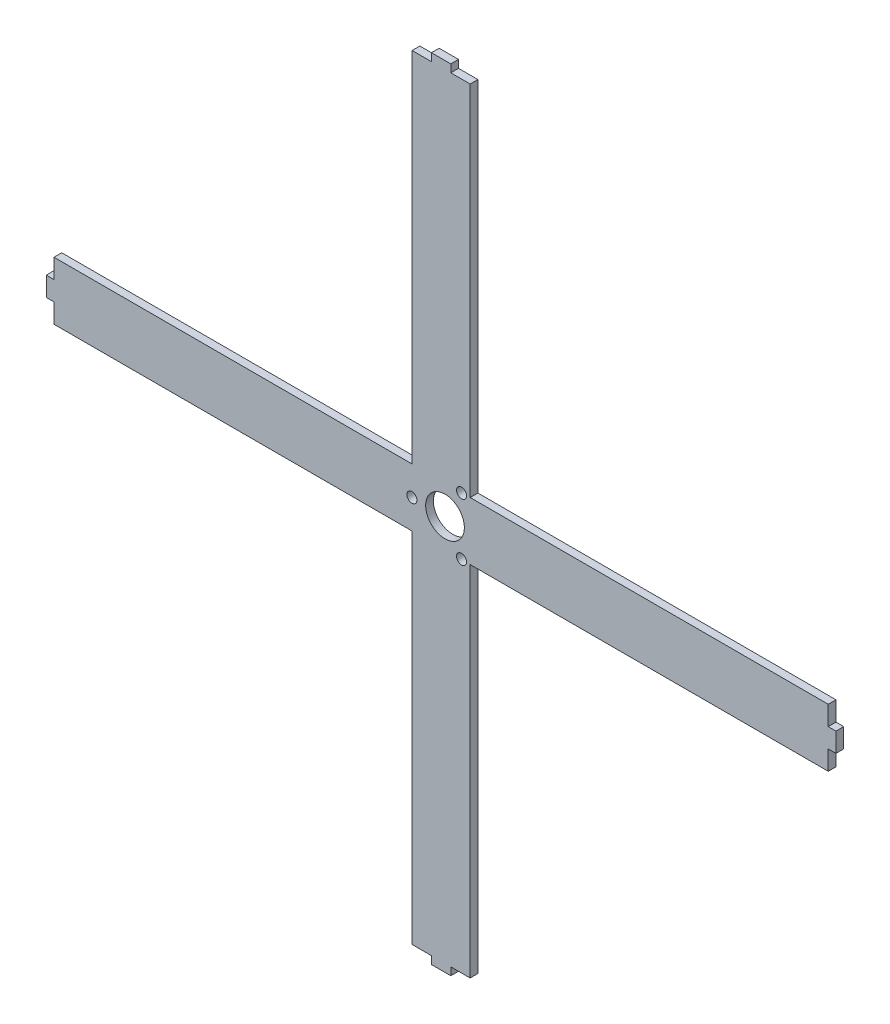
ISO-10303-21;
HEADER;
FILE_DESCRIPTION(('STEP AP214'),'2;1');
FILE_NAME('part.step','',(''),(''),'','','');
FILE_SCHEMA(('AUTOMOTIVE_DESIGN { 1 0 10303 214 1 1 1 1 }'));
ENDSEC;
DATA;
#1=APPLICATION_CONTEXT('core data for automotive mechanical design processes');
#2=APPLICATION_PROTOCOL_DEFINITION('international standard','automotive_design',2000,#1);
#3=PRODUCT_CONTEXT('',#1,'mechanical');
#4=PRODUCT('Part','Part','',(#3));
#5=PRODUCT_RELATED_PRODUCT_CATEGORY('part','',(#4));
#6=PRODUCT_DEFINITION_FORMATION('','',#4);
#7=PRODUCT_DEFINITION_CONTEXT('part definition',#1,'design');
#8=PRODUCT_DEFINITION('design','',#6,#7);
#9=PRODUCT_DEFINITION_SHAPE('','',#8);
#10=(LENGTH_UNIT() NAMED_UNIT(*) SI_UNIT(.MILLI.,.METRE.));
#11=(NAMED_UNIT(*) PLANE_ANGLE_UNIT() SI_UNIT($,.RADIAN.));
#12=(NAMED_UNIT(*) SI_UNIT($,.STERADIAN.) SOLID_ANGLE_UNIT());
#13=UNCERTAINTY_MEASURE_WITH_UNIT(LENGTH_MEASURE(1.E-05),#10,'distance_accuracy_value','');
#14=(GEOMETRIC_REPRESENTATION_CONTEXT(3) GLOBAL_UNCERTAINTY_ASSIGNED_CONTEXT((#13)) GLOBAL_UNIT_ASSIGNED_CONTEXT((#10,
#11,#12)) REPRESENTATION_CONTEXT('',''));
#15=CARTESIAN_POINT('',(0.,0.,0.));
#16=DIRECTION('',(0.,0.,1.));
#17=DIRECTION('',(1.,0.,0.));
#18=AXIS2_PLACEMENT_3D('',#15,#16,#17);
#19=CARTESIAN_POINT('',(162.342822384213,-326.680496364606,0.));
#20=DIRECTION('',(0.,0.,1.));
#21=DIRECTION('',(1.,0.,0.));
#22=AXIS2_PLACEMENT_3D('',#19,#20,#21);
#23=PLANE('',#22);
#24=CARTESIAN_POINT('',(148.486470786896,8.9002294559745,0.));
#25=DIRECTION('',(0.,0.,1.));
#26=DIRECTION('',(1.,0.,0.));
#27=AXIS2_PLACEMENT_3D('',#24,#25,#26);
#28=CIRCLE('',#27,2.6);
#29=CARTESIAN_POINT('',(151.086470786896,8.9002294559745,0.));
#30=VERTEX_POINT('',#29);
#31=EDGE_CURVE('E762',#30,#30,#28,.F.);
#32=ORIENTED_EDGE('',*,*,#31,.F.);
#33=EDGE_LOOP('',(#32));
#34=FACE_BOUND('',#33,.T.);
#35=CARTESIAN_POINT('',(174.136470786896,23.7092638606884,0.));
#36=DIRECTION('',(0.,0.,1.));
#37=DIRECTION('',(1.,0.,0.));
#38=AXIS2_PLACEMENT_3D('',#35,#36,#37);
#39=CIRCLE('',#38,2.6);
#40=CARTESIAN_POINT('',(176.736470786896,23.7092638606884,0.));
#41=VERTEX_POINT('',#40);
#42=EDGE_CURVE('E768',#41,#41,#39,.F.);
#43=ORIENTED_EDGE('',*,*,#42,.F.);
#44=EDGE_LOOP('',(#43));
#45=FACE_BOUND('',#44,.T.);
#46=DIRECTION('',(0.,1.,0.));
#47=VECTOR('',#46,1.);
#48=CARTESIAN_POINT('',(168.577070848987,204.900229455974,0.));
#49=LINE('',#48,#47);
#50=CARTESIAN_POINT('',(168.577070848987,208.900229455974,0.));
#51=VERTEX_POINT('',#50);
#52=CARTESIAN_POINT('',(168.577070848987,212.900229455974,0.));
#53=VERTEX_POINT('',#52);
#54=EDGE_CURVE('E554',#51,#53,#49,.T.);
#55=ORIENTED_EDGE('',*,*,#54,.F.);
#56=DIRECTION('',(1.,0.,0.));
#57=VECTOR('',#56,1.);
#58=CARTESIAN_POINT('',(162.342822384215,208.900229455974,0.));
#59=LINE('',#58,#57);
#60=CARTESIAN_POINT('',(178.577070848987,208.900229455974,0.));
#61=VERTEX_POINT('',#60);
#62=EDGE_CURVE('E703',#51,#61,#59,.T.);
#63=ORIENTED_EDGE('',*,*,#62,.T.);
#64=DIRECTION('',(0.,-1.,0.));
#65=VECTOR('',#64,1.);
#66=CARTESIAN_POINT('',(178.577070848986,-326.680496364606,0.));
#67=LINE('',#66,#65);
#68=CARTESIAN_POINT('',(178.577070848987,23.8896634175821,0.));
#69=VERTEX_POINT('',#68);
#70=EDGE_CURVE('E705',#61,#69,#67,.T.);
#71=ORIENTED_EDGE('',*,*,#70,.T.);
#72=DIRECTION('',(1.,0.,0.));
#73=VECTOR('',#72,1.);
#74=CARTESIAN_POINT('',(162.342822384213,23.8896634175821,0.));
#75=LINE('',#74,#73);
#76=CARTESIAN_POINT('',(363.586470786896,23.8896634175821,0.));
#77=VERTEX_POINT('',#76);
#78=EDGE_CURVE('E708',#69,#77,#75,.T.);
#79=ORIENTED_EDGE('',*,*,#78,.T.);
#80=DIRECTION('',(0.,1.,0.));
#81=VECTOR('',#80,1.);
#82=CARTESIAN_POINT('',(363.586470786896,-326.680496364606,0.));
#83=LINE('',#82,#81);
#84=CARTESIAN_POINT('',(363.586470786896,13.8896634175822,0.));
#85=VERTEX_POINT('',#84);
#86=EDGE_CURVE('E711',#85,#77,#83,.T.);
#87=ORIENTED_EDGE('',*,*,#86,.F.);
#88=DIRECTION('',(-1.,0.,0.));
#89=VECTOR('',#88,1.);
#90=CARTESIAN_POINT('',(367.586470786896,13.8896634175822,0.));
#91=LINE('',#90,#89);
#92=CARTESIAN_POINT('',(367.586470786896,13.8896634175822,0.));
#93=VERTEX_POINT('',#92);
#94=EDGE_CURVE('E614',#93,#85,#91,.T.);
#95=ORIENTED_EDGE('',*,*,#94,.F.);
#96=DIRECTION('',(0.,1.,0.));
#97=VECTOR('',#96,1.);
#98=CARTESIAN_POINT('',(367.586470786896,3.8896634175822,0.));
#99=LINE('',#98,#97);
#100=CARTESIAN_POINT('',(367.586470786896,3.8896634175822,0.));
#101=VERTEX_POINT('',#100);
#102=EDGE_CURVE('E590',#101,#93,#99,.T.);
#103=ORIENTED_EDGE('',*,*,#102,.F.);
#104=DIRECTION('',(-1.,0.,0.));
#105=VECTOR('',#104,1.);
#106=CARTESIAN_POINT('',(367.586470786896,3.8896634175822,0.));
#107=LINE('',#106,#105);
#108=CARTESIAN_POINT('',(363.586470786896,3.88966341758218,0.));
#109=VERTEX_POINT('',#108);
#110=EDGE_CURVE('E610',#101,#109,#107,.T.);
#111=ORIENTED_EDGE('',*,*,#110,.T.);
#112=CARTESIAN_POINT('',(363.586470786896,-6.11033658241776,0.));
#113=VERTEX_POINT('',#112);
#114=EDGE_CURVE('E712',#113,#109,#83,.T.);
#115=ORIENTED_EDGE('',*,*,#114,.F.);
#116=DIRECTION('',(1.,0.,0.));
#117=VECTOR('',#116,1.);
#118=CARTESIAN_POINT('',(162.342822384213,-6.11033658241783,0.));
#119=LINE('',#118,#117);
#120=CARTESIAN_POINT('',(178.577070848987,-6.11033658241782,0.));
#121=VERTEX_POINT('',#120);
#122=EDGE_CURVE('E715',#121,#113,#119,.T.);
#123=ORIENTED_EDGE('',*,*,#122,.F.);
#124=DIRECTION('',(0.,-1.,0.));
#125=VECTOR('',#124,1.);
#126=CARTESIAN_POINT('',(178.577070848986,-326.680496364606,0.));
#127=LINE('',#126,#125);
#128=CARTESIAN_POINT('',(178.577070848986,-191.099770544026,0.));
#129=VERTEX_POINT('',#128);
#130=EDGE_CURVE('E717',#121,#129,#127,.T.);
#131=ORIENTED_EDGE('',*,*,#130,.T.);
#132=DIRECTION('',(1.,0.,0.));
#133=VECTOR('',#132,1.);
#134=CARTESIAN_POINT('',(162.342822384213,-191.099770544026,0.));
#135=LINE('',#134,#133);
#136=CARTESIAN_POINT('',(168.577070848986,-191.099770544026,0.));
#137=VERTEX_POINT('',#136);
#138=EDGE_CURVE('E629',#137,#129,#135,.T.);
#139=ORIENTED_EDGE('',*,*,#138,.F.);
#140=DIRECTION('',(0.,1.,0.));
#141=VECTOR('',#140,1.);
#142=CARTESIAN_POINT('',(168.577070848986,-195.099770544026,0.));
#143=LINE('',#142,#141);
#144=CARTESIAN_POINT('',(168.577070848986,-195.099770544026,0.));
#145=VERTEX_POINT('',#144);
#146=EDGE_CURVE('E637',#145,#137,#143,.T.);
#147=ORIENTED_EDGE('',*,*,#146,.F.);
#148=DIRECTION('',(1.,0.,0.));
#149=VECTOR('',#148,1.);
#150=CARTESIAN_POINT('',(158.577070848986,-195.099770544026,0.));
#151=LINE('',#150,#149);
#152=CARTESIAN_POINT('',(158.577070848986,-195.099770544026,0.));
#153=VERTEX_POINT('',#152);
#154=EDGE_CURVE('E606',#153,#145,#151,.T.);
#155=ORIENTED_EDGE('',*,*,#154,.F.);
#156=DIRECTION('',(0.,1.,0.));
#157=VECTOR('',#156,1.);
#158=CARTESIAN_POINT('',(158.577070848986,-195.099770544026,0.));
#159=LINE('',#158,#157);
#160=CARTESIAN_POINT('',(158.577070848986,-191.099770544026,0.));
#161=VERTEX_POINT('',#160);
#162=EDGE_CURVE('E633',#153,#161,#159,.T.);
#163=ORIENTED_EDGE('',*,*,#162,.T.);
#164=CARTESIAN_POINT('',(148.577070848986,-191.099770544026,0.));
#165=VERTEX_POINT('',#164);
#166=EDGE_CURVE('E689',#165,#161,#135,.T.);
#167=ORIENTED_EDGE('',*,*,#166,.F.);
#168=DIRECTION('',(0.,-1.,0.));
#169=VECTOR('',#168,1.);
#170=CARTESIAN_POINT('',(148.577070848986,-326.680496364606,0.));
#171=LINE('',#170,#169);
#172=CARTESIAN_POINT('',(148.577070848987,-6.11033658241784,0.));
#173=VERTEX_POINT('',#172);
#174=EDGE_CURVE('E687',#173,#165,#171,.T.);
#175=ORIENTED_EDGE('',*,*,#174,.F.);
#176=DIRECTION('',(1.,0.,0.));
#177=VECTOR('',#176,1.);
#178=CARTESIAN_POINT('',(162.342822384213,-6.11033658241783,0.));
#179=LINE('',#178,#177);
#180=CARTESIAN_POINT('',(-36.4135292131036,-6.1103365824179,0.));
#181=VERTEX_POINT('',#180);
#182=EDGE_CURVE('E690',#181,#173,#179,.T.);
#183=ORIENTED_EDGE('',*,*,#182,.F.);
#184=DIRECTION('',(0.,1.,0.));
#185=VECTOR('',#184,1.);
#186=CARTESIAN_POINT('',(-36.4135292131036,-326.680496364606,0.));
#187=LINE('',#186,#185);
#188=CARTESIAN_POINT('',(-36.4135292131036,3.88966341758212,0.));
#189=VERTEX_POINT('',#188);
#190=EDGE_CURVE('E692',#181,#189,#187,.T.);
#191=ORIENTED_EDGE('',*,*,#190,.T.);
#192=DIRECTION('',(-1.,0.,0.));
#193=VECTOR('',#192,1.);
#194=CARTESIAN_POINT('',(-32.4135292131036,3.88966341758213,0.));
#195=LINE('',#194,#193);
#196=CARTESIAN_POINT('',(-40.4135292131036,3.88966341758213,0.));
#197=VERTEX_POINT('',#196);
#198=EDGE_CURVE('E573',#189,#197,#195,.T.);
#199=ORIENTED_EDGE('',*,*,#198,.T.);
#200=DIRECTION('',(0.,1.,0.));
#201=VECTOR('',#200,1.);
#202=CARTESIAN_POINT('',(-40.4135292131036,3.88966341758213,0.));
#203=LINE('',#202,#201);
#204=CARTESIAN_POINT('',(-40.4135292131036,13.8896634175821,0.));
#205=VERTEX_POINT('',#204);
#206=EDGE_CURVE('E594',#197,#205,#203,.T.);
#207=ORIENTED_EDGE('',*,*,#206,.T.);
#208=DIRECTION('',(-1.,0.,0.));
#209=VECTOR('',#208,1.);
#210=CARTESIAN_POINT('',(-32.4135292131036,13.8896634175821,0.));
#211=LINE('',#210,#209);
#212=CARTESIAN_POINT('',(-36.4135292131036,13.8896634175821,0.));
#213=VERTEX_POINT('',#212);
#214=EDGE_CURVE('E591',#213,#205,#211,.T.);
#215=ORIENTED_EDGE('',*,*,#214,.F.);
#216=CARTESIAN_POINT('',(-36.4135292131036,23.8896634175821,0.));
#217=VERTEX_POINT('',#216);
#218=EDGE_CURVE('E693',#213,#217,#187,.T.);
#219=ORIENTED_EDGE('',*,*,#218,.T.);
#220=DIRECTION('',(1.,0.,0.));
#221=VECTOR('',#220,1.);
#222=CARTESIAN_POINT('',(162.342822384213,23.8896634175821,0.));
#223=LINE('',#222,#221);
#224=CARTESIAN_POINT('',(148.577070848987,23.8896634175821,0.));
#225=VERTEX_POINT('',#224);
#226=EDGE_CURVE('E696',#217,#225,#223,.T.);
#227=ORIENTED_EDGE('',*,*,#226,.T.);
#228=DIRECTION('',(0.,-1.,0.));
#229=VECTOR('',#228,1.);
#230=CARTESIAN_POINT('',(148.577070848986,-326.680496364606,0.));
#231=LINE('',#230,#229);
#232=CARTESIAN_POINT('',(148.577070848987,208.900229455974,0.));
#233=VERTEX_POINT('',#232);
#234=EDGE_CURVE('E699',#233,#225,#231,.T.);
#235=ORIENTED_EDGE('',*,*,#234,.F.);
#236=CARTESIAN_POINT('',(158.577070848987,208.900229455974,0.));
#237=VERTEX_POINT('',#236);
#238=EDGE_CURVE('E702',#233,#237,#59,.T.);
#239=ORIENTED_EDGE('',*,*,#238,.T.);
#240=DIRECTION('',(0.,1.,0.));
#241=VECTOR('',#240,1.);
#242=CARTESIAN_POINT('',(158.577070848987,204.900229455974,0.));
#243=LINE('',#242,#241);
#244=CARTESIAN_POINT('',(158.577070848987,212.900229455974,0.));
#245=VERTEX_POINT('',#244);
#246=EDGE_CURVE('E548',#237,#245,#243,.T.);
#247=ORIENTED_EDGE('',*,*,#246,.T.);
#248=DIRECTION('',(1.,0.,0.));
#249=VECTOR('',#248,1.);
#250=CARTESIAN_POINT('',(158.577070848987,212.900229455974,0.));
#251=LINE('',#250,#249);
#252=EDGE_CURVE('E565',#245,#53,#251,.T.);
#253=ORIENTED_EDGE('',*,*,#252,.T.);
#254=EDGE_LOOP('',(#55,#63,#71,#79,#87,#95,#103,#111,#115,#123,#131,#139,#147,#155,#163,#167,
#175,#183,#191,#199,#207,#215,#219,#227,#235,#239,#247,#253));
#255=FACE_BOUND('',#254,.T.);
#256=CARTESIAN_POINT('',(174.136470786896,-5.9088049487394,0.));
#257=DIRECTION('',(0.,0.,1.));
#258=DIRECTION('',(1.,0.,0.));
#259=AXIS2_PLACEMENT_3D('',#256,#257,#258);
#260=CIRCLE('',#259,2.6);
#261=CARTESIAN_POINT('',(176.736470786896,-5.9088049487394,0.));
#262=VERTEX_POINT('',#261);
#263=EDGE_CURVE('E765',#262,#262,#260,.F.);
#264=ORIENTED_EDGE('',*,*,#263,.F.);
#265=EDGE_LOOP('',(#264));
#266=FACE_BOUND('',#265,.T.);
#267=CARTESIAN_POINT('',(165.586470786896,8.9002294559745,0.));
#268=DIRECTION('',(0.,0.,1.));
#269=DIRECTION('',(1.,0.,0.));
#270=AXIS2_PLACEMENT_3D('',#267,#268,#269);
#271=CIRCLE('',#270,10.);
#272=CARTESIAN_POINT('',(175.586470786896,8.9002294559745,0.));
#273=VERTEX_POINT('',#272);
#274=EDGE_CURVE('E576',#273,#273,#271,.F.);
#275=ORIENTED_EDGE('',*,*,#274,.F.);
#276=EDGE_LOOP('',(#275));
#277=FACE_BOUND('',#276,.T.);
#278=ADVANCED_FACE('F416',(#34,#45,#255,#266,#277),#23,.F.);
#279=CARTESIAN_POINT('',(162.342822384213,-326.680496364606,4.));
#280=DIRECTION('',(0.,0.,1.));
#281=DIRECTION('',(1.,0.,0.));
#282=AXIS2_PLACEMENT_3D('',#279,#280,#281);
#283=PLANE('',#282);
#284=DIRECTION('',(1.,0.,0.));
#285=VECTOR('',#284,1.);
#286=CARTESIAN_POINT('',(162.342822384213,23.8896634175821,4.));
#287=LINE('',#286,#285);
#288=CARTESIAN_POINT('',(178.577070848987,23.8896634175821,4.));
#289=VERTEX_POINT('',#288);
#290=CARTESIAN_POINT('',(363.586470786896,23.8896634175821,4.));
#291=VERTEX_POINT('',#290);
#292=EDGE_CURVE('E744',#289,#291,#287,.T.);
#293=ORIENTED_EDGE('',*,*,#292,.F.);
#294=DIRECTION('',(0.,-1.,0.));
#295=VECTOR('',#294,1.);
#296=CARTESIAN_POINT('',(178.577070848986,-326.680496364606,4.));
#297=LINE('',#296,#295);
#298=CARTESIAN_POINT('',(178.577070848987,208.900229455974,4.));
#299=VERTEX_POINT('',#298);
#300=EDGE_CURVE('E741',#299,#289,#297,.T.);
#301=ORIENTED_EDGE('',*,*,#300,.F.);
#302=DIRECTION('',(1.,0.,0.));
#303=VECTOR('',#302,1.);
#304=CARTESIAN_POINT('',(162.342822384215,208.900229455974,4.));
#305=LINE('',#304,#303);
#306=CARTESIAN_POINT('',(168.577070848987,208.900229455974,4.));
#307=VERTEX_POINT('',#306);
#308=EDGE_CURVE('E738',#307,#299,#305,.T.);
#309=ORIENTED_EDGE('',*,*,#308,.F.);
#310=DIRECTION('',(0.,1.,0.));
#311=VECTOR('',#310,1.);
#312=CARTESIAN_POINT('',(168.577070848987,204.900229455974,4.));
#313=LINE('',#312,#311);
#314=CARTESIAN_POINT('',(168.577070848987,212.900229455974,4.));
#315=VERTEX_POINT('',#314);
#316=EDGE_CURVE('E579',#307,#315,#313,.T.);
#317=ORIENTED_EDGE('',*,*,#316,.T.);
#318=DIRECTION('',(1.,0.,0.));
#319=VECTOR('',#318,1.);
#320=CARTESIAN_POINT('',(158.577070848987,212.900229455974,4.));
#321=LINE('',#320,#319);
#322=CARTESIAN_POINT('',(158.577070848987,212.900229455974,4.));
#323=VERTEX_POINT('',#322);
#324=EDGE_CURVE('E572',#323,#315,#321,.T.);
#325=ORIENTED_EDGE('',*,*,#324,.F.);
#326=DIRECTION('',(0.,1.,0.));
#327=VECTOR('',#326,1.);
#328=CARTESIAN_POINT('',(158.577070848987,204.900229455974,4.));
#329=LINE('',#328,#327);
#330=CARTESIAN_POINT('',(158.577070848987,208.900229455974,4.));
#331=VERTEX_POINT('',#330);
#332=EDGE_CURVE('E564',#331,#323,#329,.T.);
#333=ORIENTED_EDGE('',*,*,#332,.F.);
#334=CARTESIAN_POINT('',(148.577070848987,208.900229455974,4.));
#335=VERTEX_POINT('',#334);
#336=EDGE_CURVE('E737',#335,#331,#305,.T.);
#337=ORIENTED_EDGE('',*,*,#336,.F.);
#338=DIRECTION('',(0.,-1.,0.));
#339=VECTOR('',#338,1.);
#340=CARTESIAN_POINT('',(148.577070848986,-326.680496364606,4.));
#341=LINE('',#340,#339);
#342=CARTESIAN_POINT('',(148.577070848987,23.8896634175821,4.));
#343=VERTEX_POINT('',#342);
#344=EDGE_CURVE('E734',#335,#343,#341,.T.);
#345=ORIENTED_EDGE('',*,*,#344,.T.);
#346=DIRECTION('',(1.,0.,0.));
#347=VECTOR('',#346,1.);
#348=CARTESIAN_POINT('',(162.342822384213,23.8896634175821,4.));
#349=LINE('',#348,#347);
#350=CARTESIAN_POINT('',(-36.4135292131036,23.8896634175821,4.));
#351=VERTEX_POINT('',#350);
#352=EDGE_CURVE('E731',#351,#343,#349,.T.);
#353=ORIENTED_EDGE('',*,*,#352,.F.);
#354=DIRECTION('',(0.,1.,0.));
#355=VECTOR('',#354,1.);
#356=CARTESIAN_POINT('',(-36.4135292131036,-326.680496364606,4.));
#357=LINE('',#356,#355);
#358=CARTESIAN_POINT('',(-36.4135292131036,13.8896634175821,4.));
#359=VERTEX_POINT('',#358);
#360=EDGE_CURVE('E728',#359,#351,#357,.T.);
#361=ORIENTED_EDGE('',*,*,#360,.F.);
#362=DIRECTION('',(-1.,0.,0.));
#363=VECTOR('',#362,1.);
#364=CARTESIAN_POINT('',(-32.4135292131036,13.8896634175821,4.));
#365=LINE('',#364,#363);
#366=CARTESIAN_POINT('',(-40.4135292131036,13.8896634175821,4.));
#367=VERTEX_POINT('',#366);
#368=EDGE_CURVE('E587',#359,#367,#365,.T.);
#369=ORIENTED_EDGE('',*,*,#368,.T.);
#370=DIRECTION('',(0.,1.,0.));
#371=VECTOR('',#370,1.);
#372=CARTESIAN_POINT('',(-40.4135292131036,3.88966341758213,4.));
#373=LINE('',#372,#371);
#374=CARTESIAN_POINT('',(-40.4135292131036,3.88966341758213,4.));
#375=VERTEX_POINT('',#374);
#376=EDGE_CURVE('E599',#375,#367,#373,.T.);
#377=ORIENTED_EDGE('',*,*,#376,.F.);
#378=DIRECTION('',(-1.,0.,0.));
#379=VECTOR('',#378,1.);
#380=CARTESIAN_POINT('',(-32.4135292131036,3.88966341758213,4.));
#381=LINE('',#380,#379);
#382=CARTESIAN_POINT('',(-36.4135292131036,3.88966341758212,4.));
#383=VERTEX_POINT('',#382);
#384=EDGE_CURVE('E593',#383,#375,#381,.T.);
#385=ORIENTED_EDGE('',*,*,#384,.F.);
#386=CARTESIAN_POINT('',(-36.4135292131036,-6.1103365824179,4.));
#387=VERTEX_POINT('',#386);
#388=EDGE_CURVE('E727',#387,#383,#357,.T.);
#389=ORIENTED_EDGE('',*,*,#388,.F.);
#390=DIRECTION('',(1.,0.,0.));
#391=VECTOR('',#390,1.);
#392=CARTESIAN_POINT('',(162.342822384213,-6.11033658241783,4.));
#393=LINE('',#392,#391);
#394=CARTESIAN_POINT('',(148.577070848987,-6.11033658241784,4.));
#395=VERTEX_POINT('',#394);
#396=EDGE_CURVE('E724',#387,#395,#393,.T.);
#397=ORIENTED_EDGE('',*,*,#396,.T.);
#398=DIRECTION('',(0.,-1.,0.));
#399=VECTOR('',#398,1.);
#400=CARTESIAN_POINT('',(148.577070848986,-326.680496364606,4.));
#401=LINE('',#400,#399);
#402=CARTESIAN_POINT('',(148.577070848986,-191.099770544026,4.));
#403=VERTEX_POINT('',#402);
#404=EDGE_CURVE('E722',#395,#403,#401,.T.);
#405=ORIENTED_EDGE('',*,*,#404,.T.);
#406=DIRECTION('',(1.,0.,0.));
#407=VECTOR('',#406,1.);
#408=CARTESIAN_POINT('',(162.342822384213,-191.099770544026,4.));
#409=LINE('',#408,#407);
#410=CARTESIAN_POINT('',(158.577070848986,-191.099770544026,4.));
#411=VERTEX_POINT('',#410);
#412=EDGE_CURVE('E686',#403,#411,#409,.T.);
#413=ORIENTED_EDGE('',*,*,#412,.T.);
#414=DIRECTION('',(0.,1.,0.));
#415=VECTOR('',#414,1.);
#416=CARTESIAN_POINT('',(158.577070848986,-195.099770544026,4.));
#417=LINE('',#416,#415);
#418=CARTESIAN_POINT('',(158.577070848986,-195.099770544026,4.));
#419=VERTEX_POINT('',#418);
#420=EDGE_CURVE('E632',#419,#411,#417,.T.);
#421=ORIENTED_EDGE('',*,*,#420,.F.);
#422=DIRECTION('',(1.,0.,0.));
#423=VECTOR('',#422,1.);
#424=CARTESIAN_POINT('',(158.577070848986,-195.099770544026,4.));
#425=LINE('',#424,#423);
#426=CARTESIAN_POINT('',(168.577070848986,-195.099770544026,4.));
#427=VERTEX_POINT('',#426);
#428=EDGE_CURVE('E636',#419,#427,#425,.T.);
#429=ORIENTED_EDGE('',*,*,#428,.T.);
#430=DIRECTION('',(0.,1.,0.));
#431=VECTOR('',#430,1.);
#432=CARTESIAN_POINT('',(168.577070848986,-195.099770544026,4.));
#433=LINE('',#432,#431);
#434=CARTESIAN_POINT('',(168.577070848986,-191.099770544026,4.));
#435=VERTEX_POINT('',#434);
#436=EDGE_CURVE('E643',#427,#435,#433,.T.);
#437=ORIENTED_EDGE('',*,*,#436,.T.);
#438=CARTESIAN_POINT('',(178.577070848986,-191.099770544026,4.));
#439=VERTEX_POINT('',#438);
#440=EDGE_CURVE('E757',#435,#439,#409,.T.);
#441=ORIENTED_EDGE('',*,*,#440,.T.);
#442=DIRECTION('',(0.,-1.,0.));
#443=VECTOR('',#442,1.);
#444=CARTESIAN_POINT('',(178.577070848986,-326.680496364606,4.));
#445=LINE('',#444,#443);
#446=CARTESIAN_POINT('',(178.577070848987,-6.11033658241782,4.));
#447=VERTEX_POINT('',#446);
#448=EDGE_CURVE('E754',#447,#439,#445,.T.);
#449=ORIENTED_EDGE('',*,*,#448,.F.);
#450=DIRECTION('',(1.,0.,0.));
#451=VECTOR('',#450,1.);
#452=CARTESIAN_POINT('',(162.342822384213,-6.11033658241783,4.));
#453=LINE('',#452,#451);
#454=CARTESIAN_POINT('',(363.586470786896,-6.11033658241776,4.));
#455=VERTEX_POINT('',#454);
#456=EDGE_CURVE('E751',#447,#455,#453,.T.);
#457=ORIENTED_EDGE('',*,*,#456,.T.);
#458=DIRECTION('',(0.,1.,0.));
#459=VECTOR('',#458,1.);
#460=CARTESIAN_POINT('',(363.586470786896,-326.680496364606,4.));
#461=LINE('',#460,#459);
#462=CARTESIAN_POINT('',(363.586470786896,3.88966341758218,4.));
#463=VERTEX_POINT('',#462);
#464=EDGE_CURVE('E748',#455,#463,#461,.T.);
#465=ORIENTED_EDGE('',*,*,#464,.T.);
#466=DIRECTION('',(-1.,0.,0.));
#467=VECTOR('',#466,1.);
#468=CARTESIAN_POINT('',(367.586470786896,3.8896634175822,4.));
#469=LINE('',#468,#467);
#470=CARTESIAN_POINT('',(367.586470786896,3.8896634175822,4.));
#471=VERTEX_POINT('',#470);
#472=EDGE_CURVE('E609',#471,#463,#469,.T.);
#473=ORIENTED_EDGE('',*,*,#472,.F.);
#474=DIRECTION('',(0.,1.,0.));
#475=VECTOR('',#474,1.);
#476=CARTESIAN_POINT('',(367.586470786896,3.8896634175822,4.));
#477=LINE('',#476,#475);
#478=CARTESIAN_POINT('',(367.586470786896,13.8896634175822,4.));
#479=VERTEX_POINT('',#478);
#480=EDGE_CURVE('E613',#471,#479,#477,.T.);
#481=ORIENTED_EDGE('',*,*,#480,.T.);
#482=DIRECTION('',(-1.,0.,0.));
#483=VECTOR('',#482,1.);
#484=CARTESIAN_POINT('',(367.586470786896,13.8896634175822,4.));
#485=LINE('',#484,#483);
#486=CARTESIAN_POINT('',(363.586470786896,13.8896634175822,4.));
#487=VERTEX_POINT('',#486);
#488=EDGE_CURVE('E621',#479,#487,#485,.T.);
#489=ORIENTED_EDGE('',*,*,#488,.T.);
#490=EDGE_CURVE('E747',#487,#291,#461,.T.);
#491=ORIENTED_EDGE('',*,*,#490,.T.);
#492=EDGE_LOOP('',(#293,#301,#309,#317,#325,#333,#337,#345,#353,#361,#369,#377,#385,#389,#397,
#405,#413,#421,#429,#437,#441,#449,#457,#465,#473,#481,#489,#491));
#493=FACE_BOUND('',#492,.T.);
#494=CARTESIAN_POINT('',(148.486470786896,8.9002294559745,4.));
#495=DIRECTION('',(0.,0.,1.));
#496=DIRECTION('',(1.,0.,0.));
#497=AXIS2_PLACEMENT_3D('',#494,#495,#496);
#498=CIRCLE('',#497,2.6);
#499=CARTESIAN_POINT('',(151.086470786896,8.9002294559745,4.));
#500=VERTEX_POINT('',#499);
#501=EDGE_CURVE('E777',#500,#500,#498,.F.);
#502=ORIENTED_EDGE('',*,*,#501,.T.);
#503=EDGE_LOOP('',(#502));
#504=FACE_BOUND('',#503,.T.);
#505=CARTESIAN_POINT('',(174.136470786896,23.7092638606884,4.));
#506=DIRECTION('',(0.,0.,1.));
#507=DIRECTION('',(1.,0.,0.));
#508=AXIS2_PLACEMENT_3D('',#505,#506,#507);
#509=CIRCLE('',#508,2.6);
#510=CARTESIAN_POINT('',(176.736470786896,23.7092638606884,4.));
#511=VERTEX_POINT('',#510);
#512=EDGE_CURVE('E771',#511,#511,#509,.F.);
#513=ORIENTED_EDGE('',*,*,#512,.T.);
#514=EDGE_LOOP('',(#513));
#515=FACE_BOUND('',#514,.T.);
#516=CARTESIAN_POINT('',(174.136470786896,-5.9088049487394,4.));
#517=DIRECTION('',(0.,0.,1.));
#518=DIRECTION('',(1.,0.,0.));
#519=AXIS2_PLACEMENT_3D('',#516,#517,#518);
#520=CIRCLE('',#519,2.6);
#521=CARTESIAN_POINT('',(176.736470786896,-5.9088049487394,4.));
#522=VERTEX_POINT('',#521);
#523=EDGE_CURVE('E774',#522,#522,#520,.F.);
#524=ORIENTED_EDGE('',*,*,#523,.T.);
#525=EDGE_LOOP('',(#524));
#526=FACE_BOUND('',#525,.T.);
#527=CARTESIAN_POINT('',(165.586470786896,8.9002294559745,4.));
#528=DIRECTION('',(0.,0.,1.));
#529=DIRECTION('',(1.,0.,0.));
#530=AXIS2_PLACEMENT_3D('',#527,#528,#529);
#531=CIRCLE('',#530,10.);
#532=CARTESIAN_POINT('',(175.586470786896,8.9002294559745,4.));
#533=VERTEX_POINT('',#532);
#534=EDGE_CURVE('E780',#533,#533,#531,.F.);
#535=ORIENTED_EDGE('',*,*,#534,.T.);
#536=EDGE_LOOP('',(#535));
#537=FACE_BOUND('',#536,.T.);
#538=ADVANCED_FACE('F784',(#493,#504,#515,#526,#537),#283,.T.);
#539=CARTESIAN_POINT('',(162.342822384213,-191.099770544026,4.));
#540=DIRECTION('',(0.,1.,0.));
#541=DIRECTION('',(-1.,0.,0.));
#542=AXIS2_PLACEMENT_3D('',#539,#540,#541);
#543=PLANE('',#542);
#544=ORIENTED_EDGE('',*,*,#138,.T.);
#545=DIRECTION('',(0.,0.,-1.));
#546=VECTOR('',#545,1.);
#547=CARTESIAN_POINT('',(178.577070848986,-191.099770544026,4.));
#548=LINE('',#547,#546);
#549=EDGE_CURVE('E426',#439,#129,#548,.T.);
#550=ORIENTED_EDGE('',*,*,#549,.F.);
#551=ORIENTED_EDGE('',*,*,#440,.F.);
#552=DIRECTION('',(0.,0.,-1.));
#553=VECTOR('',#552,1.);
#554=CARTESIAN_POINT('',(168.577070848986,-191.099770544026,4.));
#555=LINE('',#554,#553);
#556=EDGE_CURVE('E12',#435,#137,#555,.T.);
#557=ORIENTED_EDGE('',*,*,#556,.T.);
#558=EDGE_LOOP('',(#544,#550,#551,#557));
#559=FACE_BOUND('',#558,.T.);
#560=ADVANCED_FACE('F800',(#559),#543,.F.);
#561=CARTESIAN_POINT('',(178.577070848986,-326.680496364606,4.));
#562=DIRECTION('',(1.,0.,0.));
#563=DIRECTION('',(0.,1.,0.));
#564=AXIS2_PLACEMENT_3D('',#561,#562,#563);
#565=PLANE('',#564);
#566=ORIENTED_EDGE('',*,*,#130,.F.);
#567=DIRECTION('',(0.,0.,-1.));
#568=VECTOR('',#567,1.);
#569=CARTESIAN_POINT('',(178.577070848987,-6.11033658241782,4.));
#570=LINE('',#569,#568);
#571=EDGE_CURVE('E649',#447,#121,#570,.T.);
#572=ORIENTED_EDGE('',*,*,#571,.F.);
#573=ORIENTED_EDGE('',*,*,#448,.T.);
#574=ORIENTED_EDGE('',*,*,#549,.T.);
#575=EDGE_LOOP('',(#566,#572,#573,#574));
#576=FACE_BOUND('',#575,.T.);
#577=ADVANCED_FACE('F851',(#576),#565,.T.);
#578=CARTESIAN_POINT('',(162.342822384213,-6.11033658241783,4.));
#579=DIRECTION('',(0.,1.,0.));
#580=DIRECTION('',(-1.,0.,0.));
#581=AXIS2_PLACEMENT_3D('',#578,#579,#580);
#582=PLANE('',#581);
#583=ORIENTED_EDGE('',*,*,#122,.T.);
#584=DIRECTION('',(0.,0.,-1.));
#585=VECTOR('',#584,1.);
#586=CARTESIAN_POINT('',(363.586470786896,-6.11033658241776,4.));
#587=LINE('',#586,#585);
#588=EDGE_CURVE('E651',#455,#113,#587,.T.);
#589=ORIENTED_EDGE('',*,*,#588,.F.);
#590=ORIENTED_EDGE('',*,*,#456,.F.);
#591=ORIENTED_EDGE('',*,*,#571,.T.);
#592=EDGE_LOOP('',(#583,#589,#590,#591));
#593=FACE_BOUND('',#592,.T.);
#594=ADVANCED_FACE('F848',(#593),#582,.F.);
#595=CARTESIAN_POINT('',(363.586470786896,-326.680496364606,4.));
#596=DIRECTION('',(-1.,0.,0.));
#597=DIRECTION('',(0.,0.,1.));
#598=AXIS2_PLACEMENT_3D('',#595,#596,#597);
#599=PLANE('',#598);
#600=ORIENTED_EDGE('',*,*,#114,.T.);
#601=DIRECTION('',(0.,0.,-1.));
#602=VECTOR('',#601,1.);
#603=CARTESIAN_POINT('',(363.586470786896,3.88966341758218,4.));
#604=LINE('',#603,#602);
#605=EDGE_CURVE('E654',#463,#109,#604,.T.);
#606=ORIENTED_EDGE('',*,*,#605,.F.);
#607=ORIENTED_EDGE('',*,*,#464,.F.);
#608=ORIENTED_EDGE('',*,*,#588,.T.);
#609=EDGE_LOOP('',(#600,#606,#607,#608));
#610=FACE_BOUND('',#609,.T.);
#611=ADVANCED_FACE('F846',(#610),#599,.F.);
#612=ORIENTED_EDGE('',*,*,#86,.T.);
#613=DIRECTION('',(0.,0.,-1.));
#614=VECTOR('',#613,1.);
#615=CARTESIAN_POINT('',(363.586470786896,23.8896634175821,4.));
#616=LINE('',#615,#614);
#617=EDGE_CURVE('E658',#291,#77,#616,.T.);
#618=ORIENTED_EDGE('',*,*,#617,.F.);
#619=ORIENTED_EDGE('',*,*,#490,.F.);
#620=DIRECTION('',(0.,0.,-1.));
#621=VECTOR('',#620,1.);
#622=CARTESIAN_POINT('',(363.586470786896,13.8896634175822,4.));
#623=LINE('',#622,#621);
#624=EDGE_CURVE('E656',#487,#85,#623,.T.);
#625=ORIENTED_EDGE('',*,*,#624,.T.);
#626=EDGE_LOOP('',(#612,#618,#619,#625));
#627=FACE_BOUND('',#626,.T.);
#628=ADVANCED_FACE('F842',(#627),#599,.F.);
#629=CARTESIAN_POINT('',(162.342822384213,23.8896634175821,4.));
#630=DIRECTION('',(0.,1.,0.));
#631=DIRECTION('',(-1.,0.,0.));
#632=AXIS2_PLACEMENT_3D('',#629,#630,#631);
#633=PLANE('',#632);
#634=ORIENTED_EDGE('',*,*,#78,.F.);
#635=DIRECTION('',(0.,0.,-1.));
#636=VECTOR('',#635,1.);
#637=CARTESIAN_POINT('',(178.577070848987,23.8896634175821,4.));
#638=LINE('',#637,#636);
#639=EDGE_CURVE('E660',#289,#69,#638,.T.);
#640=ORIENTED_EDGE('',*,*,#639,.F.);
#641=ORIENTED_EDGE('',*,*,#292,.T.);
#642=ORIENTED_EDGE('',*,*,#617,.T.);
#643=EDGE_LOOP('',(#634,#640,#641,#642));
#644=FACE_BOUND('',#643,.T.);
#645=ADVANCED_FACE('F838',(#644),#633,.T.);
#646=CARTESIAN_POINT('',(178.577070848986,-326.680496364606,4.));
#647=DIRECTION('',(1.,0.,0.));
#648=DIRECTION('',(0.,1.,0.));
#649=AXIS2_PLACEMENT_3D('',#646,#647,#648);
#650=PLANE('',#649);
#651=ORIENTED_EDGE('',*,*,#70,.F.);
#652=DIRECTION('',(0.,0.,-1.));
#653=VECTOR('',#652,1.);
#654=CARTESIAN_POINT('',(178.577070848987,208.900229455974,4.));
#655=LINE('',#654,#653);
#656=EDGE_CURVE('E662',#299,#61,#655,.T.);
#657=ORIENTED_EDGE('',*,*,#656,.F.);
#658=ORIENTED_EDGE('',*,*,#300,.T.);
#659=ORIENTED_EDGE('',*,*,#639,.T.);
#660=EDGE_LOOP('',(#651,#657,#658,#659));
#661=FACE_BOUND('',#660,.T.);
#662=ADVANCED_FACE('F835',(#661),#650,.T.);
#663=CARTESIAN_POINT('',(162.342822384215,208.900229455974,4.));
#664=DIRECTION('',(0.,1.,0.));
#665=DIRECTION('',(-1.,0.,0.));
#666=AXIS2_PLACEMENT_3D('',#663,#664,#665);
#667=PLANE('',#666);
#668=ORIENTED_EDGE('',*,*,#62,.F.);
#669=DIRECTION('',(0.,0.,-1.));
#670=VECTOR('',#669,1.);
#671=CARTESIAN_POINT('',(168.577070848987,208.900229455974,4.));
#672=LINE('',#671,#670);
#673=EDGE_CURVE('E561',#307,#51,#672,.T.);
#674=ORIENTED_EDGE('',*,*,#673,.F.);
#675=ORIENTED_EDGE('',*,*,#308,.T.);
#676=ORIENTED_EDGE('',*,*,#656,.T.);
#677=EDGE_LOOP('',(#668,#674,#675,#676));
#678=FACE_BOUND('',#677,.T.);
#679=ADVANCED_FACE('F833',(#678),#667,.T.);
#680=ORIENTED_EDGE('',*,*,#238,.F.);
#681=DIRECTION('',(0.,0.,-1.));
#682=VECTOR('',#681,1.);
#683=CARTESIAN_POINT('',(148.577070848987,208.900229455974,4.));
#684=LINE('',#683,#682);
#685=EDGE_CURVE('E667',#335,#233,#684,.T.);
#686=ORIENTED_EDGE('',*,*,#685,.F.);
#687=ORIENTED_EDGE('',*,*,#336,.T.);
#688=DIRECTION('',(0.,0.,-1.));
#689=VECTOR('',#688,1.);
#690=CARTESIAN_POINT('',(158.577070848987,208.900229455974,4.));
#691=LINE('',#690,#689);
#692=EDGE_CURVE('E665',#331,#237,#691,.T.);
#693=ORIENTED_EDGE('',*,*,#692,.T.);
#694=EDGE_LOOP('',(#680,#686,#687,#693));
#695=FACE_BOUND('',#694,.T.);
#696=ADVANCED_FACE('F829',(#695),#667,.T.);
#697=CARTESIAN_POINT('',(148.577070848986,-326.680496364606,4.));
#698=DIRECTION('',(1.,0.,0.));
#699=DIRECTION('',(0.,1.,0.));
#700=AXIS2_PLACEMENT_3D('',#697,#698,#699);
#701=PLANE('',#700);
#702=ORIENTED_EDGE('',*,*,#234,.T.);
#703=DIRECTION('',(0.,0.,-1.));
#704=VECTOR('',#703,1.);
#705=CARTESIAN_POINT('',(148.577070848987,23.8896634175821,4.));
#706=LINE('',#705,#704);
#707=EDGE_CURVE('E669',#343,#225,#706,.T.);
#708=ORIENTED_EDGE('',*,*,#707,.F.);
#709=ORIENTED_EDGE('',*,*,#344,.F.);
#710=ORIENTED_EDGE('',*,*,#685,.T.);
#711=EDGE_LOOP('',(#702,#708,#709,#710));
#712=FACE_BOUND('',#711,.T.);
#713=ADVANCED_FACE('F825',(#712),#701,.F.);
#714=CARTESIAN_POINT('',(162.342822384213,23.8896634175821,4.));
#715=DIRECTION('',(0.,1.,0.));
#716=DIRECTION('',(-1.,0.,0.));
#717=AXIS2_PLACEMENT_3D('',#714,#715,#716);
#718=PLANE('',#717);
#719=ORIENTED_EDGE('',*,*,#226,.F.);
#720=DIRECTION('',(0.,0.,-1.));
#721=VECTOR('',#720,1.);
#722=CARTESIAN_POINT('',(-36.4135292131036,23.8896634175821,4.));
#723=LINE('',#722,#721);
#724=EDGE_CURVE('E671',#351,#217,#723,.T.);
#725=ORIENTED_EDGE('',*,*,#724,.F.);
#726=ORIENTED_EDGE('',*,*,#352,.T.);
#727=ORIENTED_EDGE('',*,*,#707,.T.);
#728=EDGE_LOOP('',(#719,#725,#726,#727));
#729=FACE_BOUND('',#728,.T.);
#730=ADVANCED_FACE('F822',(#729),#718,.T.);
#731=CARTESIAN_POINT('',(-36.4135292131036,-326.680496364606,4.));
#732=DIRECTION('',(-1.,0.,0.));
#733=DIRECTION('',(0.,-1.,0.));
#734=AXIS2_PLACEMENT_3D('',#731,#732,#733);
#735=PLANE('',#734);
#736=ORIENTED_EDGE('',*,*,#218,.F.);
#737=DIRECTION('',(0.,0.,-1.));
#738=VECTOR('',#737,1.);
#739=CARTESIAN_POINT('',(-36.4135292131036,13.8896634175821,4.));
#740=LINE('',#739,#738);
#741=EDGE_CURVE('E673',#359,#213,#740,.T.);
#742=ORIENTED_EDGE('',*,*,#741,.F.);
#743=ORIENTED_EDGE('',*,*,#360,.T.);
#744=ORIENTED_EDGE('',*,*,#724,.T.);
#745=EDGE_LOOP('',(#736,#742,#743,#744));
#746=FACE_BOUND('',#745,.T.);
#747=ADVANCED_FACE('F820',(#746),#735,.T.);
#748=ORIENTED_EDGE('',*,*,#190,.F.);
#749=DIRECTION('',(0.,0.,-1.));
#750=VECTOR('',#749,1.);
#751=CARTESIAN_POINT('',(-36.4135292131036,-6.1103365824179,4.));
#752=LINE('',#751,#750);
#753=EDGE_CURVE('E677',#387,#181,#752,.T.);
#754=ORIENTED_EDGE('',*,*,#753,.F.);
#755=ORIENTED_EDGE('',*,*,#388,.T.);
#756=DIRECTION('',(0.,0.,-1.));
#757=VECTOR('',#756,1.);
#758=CARTESIAN_POINT('',(-36.4135292131036,3.88966341758212,4.));
#759=LINE('',#758,#757);
#760=EDGE_CURVE('E675',#383,#189,#759,.T.);
#761=ORIENTED_EDGE('',*,*,#760,.T.);
#762=EDGE_LOOP('',(#748,#754,#755,#761));
#763=FACE_BOUND('',#762,.T.);
#764=ADVANCED_FACE('F816',(#763),#735,.T.);
#765=CARTESIAN_POINT('',(162.342822384213,-6.11033658241783,4.));
#766=DIRECTION('',(0.,1.,0.));
#767=DIRECTION('',(-1.,0.,0.));
#768=AXIS2_PLACEMENT_3D('',#765,#766,#767);
#769=PLANE('',#768);
#770=ORIENTED_EDGE('',*,*,#182,.T.);
#771=DIRECTION('',(0.,0.,-1.));
#772=VECTOR('',#771,1.);
#773=CARTESIAN_POINT('',(148.577070848987,-6.11033658241784,4.));
#774=LINE('',#773,#772);
#775=EDGE_CURVE('E679',#395,#173,#774,.T.);
#776=ORIENTED_EDGE('',*,*,#775,.F.);
#777=ORIENTED_EDGE('',*,*,#396,.F.);
#778=ORIENTED_EDGE('',*,*,#753,.T.);
#779=EDGE_LOOP('',(#770,#776,#777,#778));
#780=FACE_BOUND('',#779,.T.);
#781=ADVANCED_FACE('F812',(#780),#769,.F.);
#782=CARTESIAN_POINT('',(148.577070848986,-326.680496364606,4.));
#783=DIRECTION('',(1.,0.,0.));
#784=DIRECTION('',(0.,1.,0.));
#785=AXIS2_PLACEMENT_3D('',#782,#783,#784);
#786=PLANE('',#785);
#787=ORIENTED_EDGE('',*,*,#174,.T.);
#788=DIRECTION('',(0.,0.,-1.));
#789=VECTOR('',#788,1.);
#790=CARTESIAN_POINT('',(148.577070848986,-191.099770544026,4.));
#791=LINE('',#790,#789);
#792=EDGE_CURVE('E682',#403,#165,#791,.T.);
#793=ORIENTED_EDGE('',*,*,#792,.F.);
#794=ORIENTED_EDGE('',*,*,#404,.F.);
#795=ORIENTED_EDGE('',*,*,#775,.T.);
#796=EDGE_LOOP('',(#787,#793,#794,#795));
#797=FACE_BOUND('',#796,.T.);
#798=ADVANCED_FACE('F809',(#797),#786,.F.);
#799=ORIENTED_EDGE('',*,*,#166,.T.);
#800=DIRECTION('',(0.,0.,-1.));
#801=VECTOR('',#800,1.);
#802=CARTESIAN_POINT('',(158.577070848986,-191.099770544026,4.));
#803=LINE('',#802,#801);
#804=EDGE_CURVE('E435',#411,#161,#803,.T.);
#805=ORIENTED_EDGE('',*,*,#804,.F.);
#806=ORIENTED_EDGE('',*,*,#412,.F.);
#807=ORIENTED_EDGE('',*,*,#792,.T.);
#808=EDGE_LOOP('',(#799,#805,#806,#807));
#809=FACE_BOUND('',#808,.T.);
#810=ADVANCED_FACE('F806',(#809),#543,.F.);
#811=CARTESIAN_POINT('',(168.577070848987,204.900229455974,4.));
#812=DIRECTION('',(-1.,0.,0.));
#813=DIRECTION('',(0.,-1.,0.));
#814=AXIS2_PLACEMENT_3D('',#811,#812,#813);
#815=PLANE('',#814);
#816=ORIENTED_EDGE('',*,*,#316,.F.);
#817=ORIENTED_EDGE('',*,*,#673,.T.);
#818=ORIENTED_EDGE('',*,*,#54,.T.);
#819=DIRECTION('',(0.,0.,-1.));
#820=VECTOR('',#819,1.);
#821=CARTESIAN_POINT('',(168.577070848987,212.900229455974,4.));
#822=LINE('',#821,#820);
#823=EDGE_CURVE('E558',#315,#53,#822,.T.);
#824=ORIENTED_EDGE('',*,*,#823,.F.);
#825=EDGE_LOOP('',(#816,#817,#818,#824));
#826=FACE_BOUND('',#825,.T.);
#827=ADVANCED_FACE('F557',(#826),#815,.F.);
#828=CARTESIAN_POINT('',(158.577070848987,212.900229455974,4.));
#829=DIRECTION('',(0.,1.,0.));
#830=DIRECTION('',(-1.,0.,0.));
#831=AXIS2_PLACEMENT_3D('',#828,#829,#830);
#832=PLANE('',#831);
#833=ORIENTED_EDGE('',*,*,#252,.F.);
#834=DIRECTION('',(0.,0.,-1.));
#835=VECTOR('',#834,1.);
#836=CARTESIAN_POINT('',(158.577070848987,212.900229455974,4.));
#837=LINE('',#836,#835);
#838=EDGE_CURVE('E420',#323,#245,#837,.T.);
#839=ORIENTED_EDGE('',*,*,#838,.F.);
#840=ORIENTED_EDGE('',*,*,#324,.T.);
#841=ORIENTED_EDGE('',*,*,#823,.T.);
#842=EDGE_LOOP('',(#833,#839,#840,#841));
#843=FACE_BOUND('',#842,.T.);
#844=ADVANCED_FACE('F569',(#843),#832,.T.);
#845=CARTESIAN_POINT('',(158.577070848987,204.900229455974,4.));
#846=DIRECTION('',(-1.,0.,0.));
#847=DIRECTION('',(0.,-1.,0.));
#848=AXIS2_PLACEMENT_3D('',#845,#846,#847);
#849=PLANE('',#848);
#850=ORIENTED_EDGE('',*,*,#246,.F.);
#851=ORIENTED_EDGE('',*,*,#692,.F.);
#852=ORIENTED_EDGE('',*,*,#332,.T.);
#853=ORIENTED_EDGE('',*,*,#838,.T.);
#854=EDGE_LOOP('',(#850,#851,#852,#853));
#855=FACE_BOUND('',#854,.T.);
#856=ADVANCED_FACE('F418',(#855),#849,.T.);
#857=CARTESIAN_POINT('',(-32.4135292131036,13.8896634175821,4.));
#858=DIRECTION('',(0.,-1.,0.));
#859=DIRECTION('',(0.,0.,-1.));
#860=AXIS2_PLACEMENT_3D('',#857,#858,#859);
#861=PLANE('',#860);
#862=ORIENTED_EDGE('',*,*,#368,.F.);
#863=ORIENTED_EDGE('',*,*,#741,.T.);
#864=ORIENTED_EDGE('',*,*,#214,.T.);
#865=DIRECTION('',(0.,0.,-1.));
#866=VECTOR('',#865,1.);
#867=CARTESIAN_POINT('',(-40.4135292131036,13.8896634175821,4.));
#868=LINE('',#867,#866);
#869=EDGE_CURVE('E586',#367,#205,#868,.T.);
#870=ORIENTED_EDGE('',*,*,#869,.F.);
#871=EDGE_LOOP('',(#862,#863,#864,#870));
#872=FACE_BOUND('',#871,.T.);
#873=ADVANCED_FACE('F883',(#872),#861,.F.);
#874=CARTESIAN_POINT('',(-40.4135292131036,3.88966341758213,4.));
#875=DIRECTION('',(-1.,0.,0.));
#876=DIRECTION('',(0.,0.,1.));
#877=AXIS2_PLACEMENT_3D('',#874,#875,#876);
#878=PLANE('',#877);
#879=ORIENTED_EDGE('',*,*,#206,.F.);
#880=DIRECTION('',(0.,0.,-1.));
#881=VECTOR('',#880,1.);
#882=CARTESIAN_POINT('',(-40.4135292131036,3.88966341758213,4.));
#883=LINE('',#882,#881);
#884=EDGE_CURVE('E583',#375,#197,#883,.T.);
#885=ORIENTED_EDGE('',*,*,#884,.F.);
#886=ORIENTED_EDGE('',*,*,#376,.T.);
#887=ORIENTED_EDGE('',*,*,#869,.T.);
#888=EDGE_LOOP('',(#879,#885,#886,#887));
#889=FACE_BOUND('',#888,.T.);
#890=ADVANCED_FACE('F879',(#889),#878,.T.);
#891=CARTESIAN_POINT('',(-32.4135292131036,3.88966341758213,4.));
#892=DIRECTION('',(0.,-1.,0.));
#893=DIRECTION('',(0.,0.,-1.));
#894=AXIS2_PLACEMENT_3D('',#891,#892,#893);
#895=PLANE('',#894);
#896=ORIENTED_EDGE('',*,*,#198,.F.);
#897=ORIENTED_EDGE('',*,*,#760,.F.);
#898=ORIENTED_EDGE('',*,*,#384,.T.);
#899=ORIENTED_EDGE('',*,*,#884,.T.);
#900=EDGE_LOOP('',(#896,#897,#898,#899));
#901=FACE_BOUND('',#900,.T.);
#902=ADVANCED_FACE('F877',(#901),#895,.T.);
#903=CARTESIAN_POINT('',(367.586470786896,13.8896634175822,4.));
#904=DIRECTION('',(0.,-1.,0.));
#905=DIRECTION('',(0.,0.,-1.));
#906=AXIS2_PLACEMENT_3D('',#903,#904,#905);
#907=PLANE('',#906);
#908=ORIENTED_EDGE('',*,*,#94,.T.);
#909=ORIENTED_EDGE('',*,*,#624,.F.);
#910=ORIENTED_EDGE('',*,*,#488,.F.);
#911=DIRECTION('',(0.,0.,-1.));
#912=VECTOR('',#911,1.);
#913=CARTESIAN_POINT('',(367.586470786896,13.8896634175822,4.));
#914=LINE('',#913,#912);
#915=EDGE_CURVE('E603',#479,#93,#914,.T.);
#916=ORIENTED_EDGE('',*,*,#915,.T.);
#917=EDGE_LOOP('',(#908,#909,#910,#916));
#918=FACE_BOUND('',#917,.T.);
#919=ADVANCED_FACE('F873',(#918),#907,.F.);
#920=CARTESIAN_POINT('',(367.586470786896,3.8896634175822,4.));
#921=DIRECTION('',(0.,-1.,0.));
#922=DIRECTION('',(0.,0.,-1.));
#923=AXIS2_PLACEMENT_3D('',#920,#921,#922);
#924=PLANE('',#923);
#925=ORIENTED_EDGE('',*,*,#472,.T.);
#926=ORIENTED_EDGE('',*,*,#605,.T.);
#927=ORIENTED_EDGE('',*,*,#110,.F.);
#928=DIRECTION('',(0.,0.,-1.));
#929=VECTOR('',#928,1.);
#930=CARTESIAN_POINT('',(367.586470786896,3.8896634175822,4.));
#931=LINE('',#930,#929);
#932=EDGE_CURVE('E607',#471,#101,#931,.T.);
#933=ORIENTED_EDGE('',*,*,#932,.F.);
#934=EDGE_LOOP('',(#925,#926,#927,#933));
#935=FACE_BOUND('',#934,.T.);
#936=ADVANCED_FACE('F866',(#935),#924,.T.);
#937=CARTESIAN_POINT('',(367.586470786896,3.8896634175822,4.));
#938=DIRECTION('',(-1.,0.,0.));
#939=DIRECTION('',(0.,0.,1.));
#940=AXIS2_PLACEMENT_3D('',#937,#938,#939);
#941=PLANE('',#940);
#942=ORIENTED_EDGE('',*,*,#102,.T.);
#943=ORIENTED_EDGE('',*,*,#915,.F.);
#944=ORIENTED_EDGE('',*,*,#480,.F.);
#945=ORIENTED_EDGE('',*,*,#932,.T.);
#946=EDGE_LOOP('',(#942,#943,#944,#945));
#947=FACE_BOUND('',#946,.T.);
#948=ADVANCED_FACE('F864',(#947),#941,.F.);
#949=CARTESIAN_POINT('',(168.577070848986,-195.099770544026,4.));
#950=DIRECTION('',(-1.,0.,0.));
#951=DIRECTION('',(0.,-1.,0.));
#952=AXIS2_PLACEMENT_3D('',#949,#950,#951);
#953=PLANE('',#952);
#954=ORIENTED_EDGE('',*,*,#146,.T.);
#955=ORIENTED_EDGE('',*,*,#556,.F.);
#956=ORIENTED_EDGE('',*,*,#436,.F.);
#957=DIRECTION('',(0.,0.,-1.));
#958=VECTOR('',#957,1.);
#959=CARTESIAN_POINT('',(168.577070848986,-195.099770544026,4.));
#960=LINE('',#959,#958);
#961=EDGE_CURVE('E626',#427,#145,#960,.T.);
#962=ORIENTED_EDGE('',*,*,#961,.T.);
#963=EDGE_LOOP('',(#954,#955,#956,#962));
#964=FACE_BOUND('',#963,.T.);
#965=ADVANCED_FACE('F860',(#964),#953,.F.);
#966=CARTESIAN_POINT('',(158.577070848986,-195.099770544026,4.));
#967=DIRECTION('',(-1.,0.,0.));
#968=DIRECTION('',(0.,-1.,0.));
#969=AXIS2_PLACEMENT_3D('',#966,#967,#968);
#970=PLANE('',#969);
#971=ORIENTED_EDGE('',*,*,#804,.T.);
#972=ORIENTED_EDGE('',*,*,#162,.F.);
#973=DIRECTION('',(0.,0.,-1.));
#974=VECTOR('',#973,1.);
#975=CARTESIAN_POINT('',(158.577070848986,-195.099770544026,4.));
#976=LINE('',#975,#974);
#977=EDGE_CURVE('E630',#419,#153,#976,.T.);
#978=ORIENTED_EDGE('',*,*,#977,.F.);
#979=ORIENTED_EDGE('',*,*,#420,.T.);
#980=EDGE_LOOP('',(#971,#972,#978,#979));
#981=FACE_BOUND('',#980,.T.);
#982=ADVANCED_FACE('F856',(#981),#970,.T.);
#983=CARTESIAN_POINT('',(158.577070848986,-195.099770544026,4.));
#984=DIRECTION('',(0.,1.,0.));
#985=DIRECTION('',(-1.,0.,0.));
#986=AXIS2_PLACEMENT_3D('',#983,#984,#985);
#987=PLANE('',#986);
#988=ORIENTED_EDGE('',*,*,#154,.T.);
#989=ORIENTED_EDGE('',*,*,#961,.F.);
#990=ORIENTED_EDGE('',*,*,#428,.F.);
#991=ORIENTED_EDGE('',*,*,#977,.T.);
#992=EDGE_LOOP('',(#988,#989,#990,#991));
#993=FACE_BOUND('',#992,.T.);
#994=ADVANCED_FACE('F859',(#993),#987,.F.);
#995=CARTESIAN_POINT('',(174.136470786896,23.7092638606884,-6.));
#996=DIRECTION('',(0.,0.,1.));
#997=DIRECTION('',(1.,0.,0.));
#998=AXIS2_PLACEMENT_3D('',#995,#996,#997);
#999=CYLINDRICAL_SURFACE('',#998,2.6);
#1000=ORIENTED_EDGE('',*,*,#512,.F.);
#1001=EDGE_LOOP('',(#1000));
#1002=FACE_BOUND('',#1001,.T.);
#1003=ORIENTED_EDGE('',*,*,#42,.T.);
#1004=EDGE_LOOP('',(#1003));
#1005=FACE_BOUND('',#1004,.T.);
#1006=ADVANCED_FACE('F869',(#1002,#1005),#999,.F.);
#1007=CARTESIAN_POINT('',(174.136470786896,-5.9088049487394,-6.));
#1008=DIRECTION('',(0.,0.,1.));
#1009=DIRECTION('',(1.,0.,0.));
#1010=AXIS2_PLACEMENT_3D('',#1007,#1008,#1009);
#1011=CYLINDRICAL_SURFACE('',#1010,2.6);
#1012=ORIENTED_EDGE('',*,*,#523,.F.);
#1013=EDGE_LOOP('',(#1012));
#1014=FACE_BOUND('',#1013,.T.);
#1015=ORIENTED_EDGE('',*,*,#263,.T.);
#1016=EDGE_LOOP('',(#1015));
#1017=FACE_BOUND('',#1016,.T.);
#1018=ADVANCED_FACE('F1121',(#1014,#1017),#1011,.F.);
#1019=CARTESIAN_POINT('',(148.486470786896,8.9002294559745,-6.));
#1020=DIRECTION('',(0.,0.,1.));
#1021=DIRECTION('',(1.,0.,0.));
#1022=AXIS2_PLACEMENT_3D('',#1019,#1020,#1021);
#1023=CYLINDRICAL_SURFACE('',#1022,2.6);
#1024=ORIENTED_EDGE('',*,*,#501,.F.);
#1025=EDGE_LOOP('',(#1024));
#1026=FACE_BOUND('',#1025,.T.);
#1027=ORIENTED_EDGE('',*,*,#31,.T.);
#1028=EDGE_LOOP('',(#1027));
#1029=FACE_BOUND('',#1028,.T.);
#1030=ADVANCED_FACE('F789',(#1026,#1029),#1023,.F.);
#1031=CARTESIAN_POINT('',(165.586470786896,8.9002294559745,-6.));
#1032=DIRECTION('',(0.,0.,1.));
#1033=DIRECTION('',(1.,0.,0.));
#1034=AXIS2_PLACEMENT_3D('',#1031,#1032,#1033);
#1035=CYLINDRICAL_SURFACE('',#1034,10.);
#1036=ORIENTED_EDGE('',*,*,#534,.F.);
#1037=EDGE_LOOP('',(#1036));
#1038=FACE_BOUND('',#1037,.T.);
#1039=ORIENTED_EDGE('',*,*,#274,.T.);
#1040=EDGE_LOOP('',(#1039));
#1041=FACE_BOUND('',#1040,.T.);
#1042=ADVANCED_FACE('F786',(#1038,#1041),#1035,.F.);
#1043=CLOSED_SHELL('',(#278,#538,#560,#577,#594,#611,#628,#645,#662,#679,#696,#713,#730,#747,
#764,#781,#798,#810,#827,#844,#856,#873,#890,#902,#919,#936,#948,#965,#982,#994,#1006,#1018,
#1030,#1042));
#1044=MANIFOLD_SOLID_BREP('B2',#1043);
#1045=ADVANCED_BREP_SHAPE_REPRESENTATION('',(#18,#1044),#14);
#1046=SHAPE_DEFINITION_REPRESENTATION(#9,#1045);
ENDSEC;
END-ISO-10303-21;
